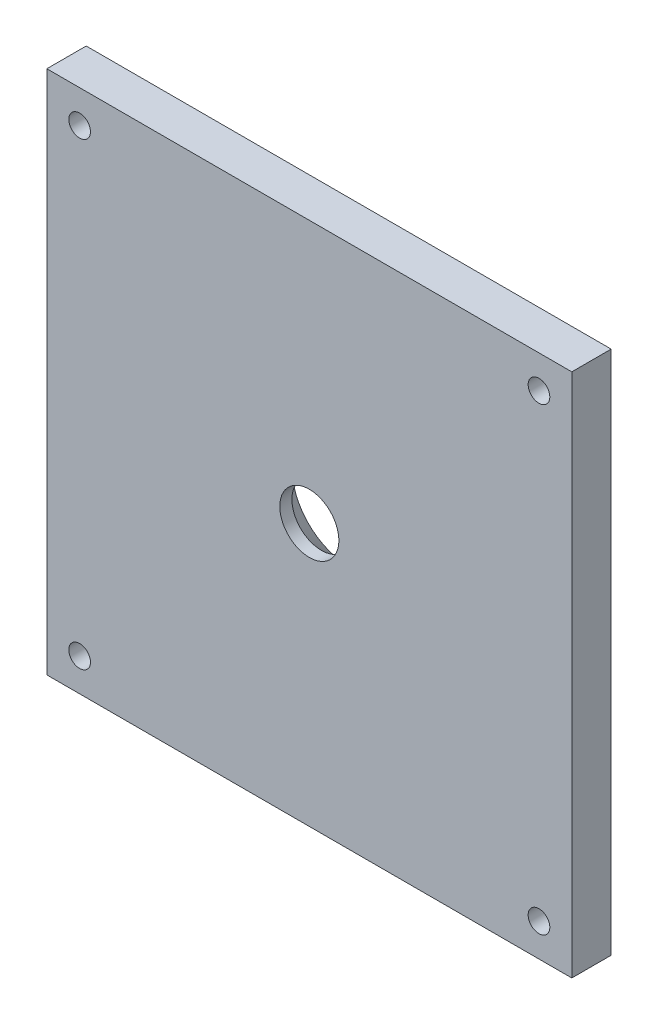
ISO-10303-21;
HEADER;
FILE_DESCRIPTION(('STEP AP214'),'2;1');
FILE_NAME('part.step','',(''),(''),'','','');
FILE_SCHEMA(('AUTOMOTIVE_DESIGN { 1 0 10303 214 1 1 1 1 }'));
ENDSEC;
DATA;
#1=APPLICATION_CONTEXT('core data for automotive mechanical design processes');
#2=APPLICATION_PROTOCOL_DEFINITION('international standard','automotive_design',2000,#1);
#3=PRODUCT_CONTEXT('',#1,'mechanical');
#4=PRODUCT('Part','Part','',(#3));
#5=PRODUCT_RELATED_PRODUCT_CATEGORY('part','',(#4));
#6=PRODUCT_DEFINITION_FORMATION('','',#4);
#7=PRODUCT_DEFINITION_CONTEXT('part definition',#1,'design');
#8=PRODUCT_DEFINITION('design','',#6,#7);
#9=PRODUCT_DEFINITION_SHAPE('','',#8);
#10=(LENGTH_UNIT() NAMED_UNIT(*) SI_UNIT(.MILLI.,.METRE.));
#11=(NAMED_UNIT(*) PLANE_ANGLE_UNIT() SI_UNIT($,.RADIAN.));
#12=(NAMED_UNIT(*) SI_UNIT($,.STERADIAN.) SOLID_ANGLE_UNIT());
#13=UNCERTAINTY_MEASURE_WITH_UNIT(LENGTH_MEASURE(1.E-05),#10,'distance_accuracy_value','');
#14=(GEOMETRIC_REPRESENTATION_CONTEXT(3) GLOBAL_UNCERTAINTY_ASSIGNED_CONTEXT((#13)) GLOBAL_UNIT_ASSIGNED_CONTEXT((#10,
#11,#12)) REPRESENTATION_CONTEXT('',''));
#15=CARTESIAN_POINT('',(0.,0.,0.));
#16=DIRECTION('',(0.,0.,1.));
#17=DIRECTION('',(1.,0.,0.));
#18=AXIS2_PLACEMENT_3D('',#15,#16,#17);
#19=CARTESIAN_POINT('',(0.,0.,6.));
#20=DIRECTION('',(0.,0.,1.));
#21=DIRECTION('',(1.,0.,0.));
#22=AXIS2_PLACEMENT_3D('',#19,#20,#21);
#23=PLANE('',#22);
#24=CARTESIAN_POINT('',(0.,0.,6.));
#25=DIRECTION('',(0.,0.,-1.));
#26=DIRECTION('',(-1.,0.,0.));
#27=AXIS2_PLACEMENT_3D('',#24,#25,#26);
#28=CIRCLE('',#27,4.5);
#29=CARTESIAN_POINT('',(-4.5,0.,6.));
#30=VERTEX_POINT('',#29);
#31=EDGE_CURVE('E141',#30,#30,#28,.T.);
#32=ORIENTED_EDGE('',*,*,#31,.T.);
#33=EDGE_LOOP('',(#32));
#34=FACE_BOUND('',#33,.T.);
#35=CARTESIAN_POINT('',(-35.0000000000001,35.,6.));
#36=DIRECTION('',(0.,0.,1.));
#37=DIRECTION('',(1.,0.,0.));
#38=AXIS2_PLACEMENT_3D('',#35,#36,#37);
#39=CIRCLE('',#38,1.64999999999999);
#40=CARTESIAN_POINT('',(-33.3500000000001,35.,6.));
#41=VERTEX_POINT('',#40);
#42=EDGE_CURVE('E135',#41,#41,#39,.T.);
#43=ORIENTED_EDGE('',*,*,#42,.F.);
#44=EDGE_LOOP('',(#43));
#45=FACE_BOUND('',#44,.T.);
#46=CARTESIAN_POINT('',(-34.9999999999999,-34.9999999999995,6.));
#47=DIRECTION('',(0.,0.,1.));
#48=DIRECTION('',(1.,0.,0.));
#49=AXIS2_PLACEMENT_3D('',#46,#47,#48);
#50=CIRCLE('',#49,1.64999999999999);
#51=CARTESIAN_POINT('',(-33.3499999999999,-34.9999999999995,6.));
#52=VERTEX_POINT('',#51);
#53=EDGE_CURVE('E129',#52,#52,#50,.T.);
#54=ORIENTED_EDGE('',*,*,#53,.F.);
#55=EDGE_LOOP('',(#54));
#56=FACE_BOUND('',#55,.T.);
#57=CARTESIAN_POINT('',(35.0000000000004,-34.9999999999997,6.));
#58=DIRECTION('',(0.,0.,1.));
#59=DIRECTION('',(1.,0.,0.));
#60=AXIS2_PLACEMENT_3D('',#57,#58,#59);
#61=CIRCLE('',#60,1.64999999999999);
#62=CARTESIAN_POINT('',(36.6500000000003,-34.9999999999997,6.));
#63=VERTEX_POINT('',#62);
#64=EDGE_CURVE('E123',#63,#63,#61,.T.);
#65=ORIENTED_EDGE('',*,*,#64,.F.);
#66=EDGE_LOOP('',(#65));
#67=FACE_BOUND('',#66,.T.);
#68=CARTESIAN_POINT('',(34.9999999999997,35.,6.));
#69=DIRECTION('',(0.,0.,1.));
#70=DIRECTION('',(1.,0.,0.));
#71=AXIS2_PLACEMENT_3D('',#68,#69,#70);
#72=CIRCLE('',#71,1.64999999999999);
#73=CARTESIAN_POINT('',(36.6499999999996,35.,6.));
#74=VERTEX_POINT('',#73);
#75=EDGE_CURVE('E107',#74,#74,#72,.T.);
#76=ORIENTED_EDGE('',*,*,#75,.F.);
#77=EDGE_LOOP('',(#76));
#78=FACE_BOUND('',#77,.T.);
#79=DIRECTION('',(0.,-1.,0.));
#80=VECTOR('',#79,1.);
#81=CARTESIAN_POINT('',(-40.,40.,6.));
#82=LINE('',#81,#80);
#83=CARTESIAN_POINT('',(-40.,40.,6.));
#84=VERTEX_POINT('',#83);
#85=CARTESIAN_POINT('',(-40.,-40.,6.));
#86=VERTEX_POINT('',#85);
#87=EDGE_CURVE('E92',#84,#86,#82,.T.);
#88=ORIENTED_EDGE('',*,*,#87,.T.);
#89=DIRECTION('',(1.,0.,0.));
#90=VECTOR('',#89,1.);
#91=CARTESIAN_POINT('',(-40.,-40.,6.));
#92=LINE('',#91,#90);
#93=CARTESIAN_POINT('',(40.,-40.,6.));
#94=VERTEX_POINT('',#93);
#95=EDGE_CURVE('E88',#86,#94,#92,.T.);
#96=ORIENTED_EDGE('',*,*,#95,.T.);
#97=DIRECTION('',(0.,1.,0.));
#98=VECTOR('',#97,1.);
#99=CARTESIAN_POINT('',(40.,40.,6.));
#100=LINE('',#99,#98);
#101=CARTESIAN_POINT('',(40.,40.,6.));
#102=VERTEX_POINT('',#101);
#103=EDGE_CURVE('E90',#94,#102,#100,.T.);
#104=ORIENTED_EDGE('',*,*,#103,.T.);
#105=DIRECTION('',(-1.,0.,0.));
#106=VECTOR('',#105,1.);
#107=CARTESIAN_POINT('',(-40.,40.,6.));
#108=LINE('',#107,#106);
#109=EDGE_CURVE('E58',#102,#84,#108,.T.);
#110=ORIENTED_EDGE('',*,*,#109,.T.);
#111=EDGE_LOOP('',(#88,#96,#104,#110));
#112=FACE_BOUND('',#111,.T.);
#113=ADVANCED_FACE('F41',(#34,#45,#56,#67,#78,#112),#23,.T.);
#114=CARTESIAN_POINT('',(0.,0.,0.));
#115=DIRECTION('',(0.,0.,1.));
#116=DIRECTION('',(1.,0.,0.));
#117=AXIS2_PLACEMENT_3D('',#114,#115,#116);
#118=PLANE('',#117);
#119=CARTESIAN_POINT('',(0.,0.,0.));
#120=DIRECTION('',(0.,0.,-1.));
#121=DIRECTION('',(-1.,0.,0.));
#122=AXIS2_PLACEMENT_3D('',#119,#120,#121);
#123=CIRCLE('',#122,8.65);
#124=CARTESIAN_POINT('',(-8.65,0.,0.));
#125=VERTEX_POINT('',#124);
#126=EDGE_CURVE('E149',#125,#125,#123,.T.);
#127=ORIENTED_EDGE('',*,*,#126,.F.);
#128=EDGE_LOOP('',(#127));
#129=FACE_BOUND('',#128,.T.);
#130=CARTESIAN_POINT('',(-35.0000000000001,35.,0.));
#131=DIRECTION('',(0.,0.,-1.));
#132=DIRECTION('',(-1.,0.,0.));
#133=AXIS2_PLACEMENT_3D('',#130,#131,#132);
#134=CIRCLE('',#133,1.64999999999999);
#135=CARTESIAN_POINT('',(-36.6500000000001,35.,0.));
#136=VERTEX_POINT('',#135);
#137=EDGE_CURVE('E138',#136,#136,#134,.T.);
#138=ORIENTED_EDGE('',*,*,#137,.F.);
#139=EDGE_LOOP('',(#138));
#140=FACE_BOUND('',#139,.T.);
#141=CARTESIAN_POINT('',(-34.9999999999999,-34.9999999999995,0.));
#142=DIRECTION('',(0.,0.,-1.));
#143=DIRECTION('',(-1.,0.,0.));
#144=AXIS2_PLACEMENT_3D('',#141,#142,#143);
#145=CIRCLE('',#144,1.64999999999999);
#146=CARTESIAN_POINT('',(-36.6499999999999,-34.9999999999995,0.));
#147=VERTEX_POINT('',#146);
#148=EDGE_CURVE('E132',#147,#147,#145,.T.);
#149=ORIENTED_EDGE('',*,*,#148,.F.);
#150=EDGE_LOOP('',(#149));
#151=FACE_BOUND('',#150,.T.);
#152=CARTESIAN_POINT('',(35.0000000000004,-34.9999999999997,0.));
#153=DIRECTION('',(0.,0.,-1.));
#154=DIRECTION('',(-1.,0.,0.));
#155=AXIS2_PLACEMENT_3D('',#152,#153,#154);
#156=CIRCLE('',#155,1.64999999999999);
#157=CARTESIAN_POINT('',(33.3500000000004,-34.9999999999997,0.));
#158=VERTEX_POINT('',#157);
#159=EDGE_CURVE('E126',#158,#158,#156,.T.);
#160=ORIENTED_EDGE('',*,*,#159,.F.);
#161=EDGE_LOOP('',(#160));
#162=FACE_BOUND('',#161,.T.);
#163=CARTESIAN_POINT('',(34.9999999999997,35.,0.));
#164=DIRECTION('',(0.,0.,-1.));
#165=DIRECTION('',(-1.,0.,0.));
#166=AXIS2_PLACEMENT_3D('',#163,#164,#165);
#167=CIRCLE('',#166,1.64999999999999);
#168=CARTESIAN_POINT('',(33.3499999999997,35.,0.));
#169=VERTEX_POINT('',#168);
#170=EDGE_CURVE('E120',#169,#169,#167,.T.);
#171=ORIENTED_EDGE('',*,*,#170,.F.);
#172=EDGE_LOOP('',(#171));
#173=FACE_BOUND('',#172,.T.);
#174=DIRECTION('',(0.,-1.,0.));
#175=VECTOR('',#174,1.);
#176=CARTESIAN_POINT('',(-40.,40.,0.));
#177=LINE('',#176,#175);
#178=CARTESIAN_POINT('',(-40.,40.,0.));
#179=VERTEX_POINT('',#178);
#180=CARTESIAN_POINT('',(-40.,-40.,0.));
#181=VERTEX_POINT('',#180);
#182=EDGE_CURVE('E104',#179,#181,#177,.T.);
#183=ORIENTED_EDGE('',*,*,#182,.F.);
#184=DIRECTION('',(-1.,0.,0.));
#185=VECTOR('',#184,1.);
#186=CARTESIAN_POINT('',(-40.,40.,0.));
#187=LINE('',#186,#185);
#188=CARTESIAN_POINT('',(40.,40.,0.));
#189=VERTEX_POINT('',#188);
#190=EDGE_CURVE('E81',#189,#179,#187,.T.);
#191=ORIENTED_EDGE('',*,*,#190,.F.);
#192=DIRECTION('',(0.,1.,0.));
#193=VECTOR('',#192,1.);
#194=CARTESIAN_POINT('',(40.,40.,0.));
#195=LINE('',#194,#193);
#196=CARTESIAN_POINT('',(40.,-40.,0.));
#197=VERTEX_POINT('',#196);
#198=EDGE_CURVE('E75',#197,#189,#195,.T.);
#199=ORIENTED_EDGE('',*,*,#198,.F.);
#200=DIRECTION('',(1.,0.,0.));
#201=VECTOR('',#200,1.);
#202=CARTESIAN_POINT('',(-40.,-40.,0.));
#203=LINE('',#202,#201);
#204=EDGE_CURVE('E96',#181,#197,#203,.T.);
#205=ORIENTED_EDGE('',*,*,#204,.F.);
#206=EDGE_LOOP('',(#183,#191,#199,#205));
#207=FACE_BOUND('',#206,.T.);
#208=ADVANCED_FACE('F115',(#129,#140,#151,#162,#173,#207),#118,.F.);
#209=CARTESIAN_POINT('',(-40.,40.,6.));
#210=DIRECTION('',(1.,0.,0.));
#211=DIRECTION('',(0.,1.,0.));
#212=AXIS2_PLACEMENT_3D('',#209,#210,#211);
#213=PLANE('',#212);
#214=ORIENTED_EDGE('',*,*,#182,.T.);
#215=DIRECTION('',(0.,0.,-1.));
#216=VECTOR('',#215,1.);
#217=CARTESIAN_POINT('',(-40.,-40.,6.));
#218=LINE('',#217,#216);
#219=EDGE_CURVE('E11',#86,#181,#218,.T.);
#220=ORIENTED_EDGE('',*,*,#219,.F.);
#221=ORIENTED_EDGE('',*,*,#87,.F.);
#222=DIRECTION('',(0.,0.,-1.));
#223=VECTOR('',#222,1.);
#224=CARTESIAN_POINT('',(-40.,40.,6.));
#225=LINE('',#224,#223);
#226=EDGE_CURVE('E100',#84,#179,#225,.T.);
#227=ORIENTED_EDGE('',*,*,#226,.T.);
#228=EDGE_LOOP('',(#214,#220,#221,#227));
#229=FACE_BOUND('',#228,.T.);
#230=ADVANCED_FACE('F43',(#229),#213,.F.);
#231=CARTESIAN_POINT('',(-40.,-40.,6.));
#232=DIRECTION('',(0.,1.,0.));
#233=DIRECTION('',(-1.,0.,0.));
#234=AXIS2_PLACEMENT_3D('',#231,#232,#233);
#235=PLANE('',#234);
#236=ORIENTED_EDGE('',*,*,#204,.T.);
#237=DIRECTION('',(0.,0.,-1.));
#238=VECTOR('',#237,1.);
#239=CARTESIAN_POINT('',(40.,-40.,6.));
#240=LINE('',#239,#238);
#241=EDGE_CURVE('E50',#94,#197,#240,.T.);
#242=ORIENTED_EDGE('',*,*,#241,.F.);
#243=ORIENTED_EDGE('',*,*,#95,.F.);
#244=ORIENTED_EDGE('',*,*,#219,.T.);
#245=EDGE_LOOP('',(#236,#242,#243,#244));
#246=FACE_BOUND('',#245,.T.);
#247=ADVANCED_FACE('F95',(#246),#235,.F.);
#248=CARTESIAN_POINT('',(40.,40.,6.));
#249=DIRECTION('',(-1.,0.,0.));
#250=DIRECTION('',(0.,0.,1.));
#251=AXIS2_PLACEMENT_3D('',#248,#249,#250);
#252=PLANE('',#251);
#253=ORIENTED_EDGE('',*,*,#198,.T.);
#254=DIRECTION('',(0.,0.,-1.));
#255=VECTOR('',#254,1.);
#256=CARTESIAN_POINT('',(40.,40.,6.));
#257=LINE('',#256,#255);
#258=EDGE_CURVE('E97',#102,#189,#257,.T.);
#259=ORIENTED_EDGE('',*,*,#258,.F.);
#260=ORIENTED_EDGE('',*,*,#103,.F.);
#261=ORIENTED_EDGE('',*,*,#241,.T.);
#262=EDGE_LOOP('',(#253,#259,#260,#261));
#263=FACE_BOUND('',#262,.T.);
#264=ADVANCED_FACE('F98',(#263),#252,.F.);
#265=CARTESIAN_POINT('',(-40.,40.,6.));
#266=DIRECTION('',(0.,-1.,0.));
#267=DIRECTION('',(1.,0.,0.));
#268=AXIS2_PLACEMENT_3D('',#265,#266,#267);
#269=PLANE('',#268);
#270=ORIENTED_EDGE('',*,*,#190,.T.);
#271=ORIENTED_EDGE('',*,*,#226,.F.);
#272=ORIENTED_EDGE('',*,*,#109,.F.);
#273=ORIENTED_EDGE('',*,*,#258,.T.);
#274=EDGE_LOOP('',(#270,#271,#272,#273));
#275=FACE_BOUND('',#274,.T.);
#276=ADVANCED_FACE('F112',(#275),#269,.F.);
#277=CARTESIAN_POINT('',(34.9999999999997,35.,0.));
#278=DIRECTION('',(0.,0.,-1.));
#279=DIRECTION('',(-1.,0.,0.));
#280=AXIS2_PLACEMENT_3D('',#277,#278,#279);
#281=CYLINDRICAL_SURFACE('',#280,1.64999999999999);
#282=ORIENTED_EDGE('',*,*,#75,.T.);
#283=EDGE_LOOP('',(#282));
#284=FACE_BOUND('',#283,.T.);
#285=ORIENTED_EDGE('',*,*,#170,.T.);
#286=EDGE_LOOP('',(#285));
#287=FACE_BOUND('',#286,.T.);
#288=ADVANCED_FACE('F167',(#284,#287),#281,.F.);
#289=CARTESIAN_POINT('',(35.0000000000004,-34.9999999999997,0.));
#290=DIRECTION('',(0.,0.,-1.));
#291=DIRECTION('',(-1.,0.,0.));
#292=AXIS2_PLACEMENT_3D('',#289,#290,#291);
#293=CYLINDRICAL_SURFACE('',#292,1.64999999999999);
#294=ORIENTED_EDGE('',*,*,#64,.T.);
#295=EDGE_LOOP('',(#294));
#296=FACE_BOUND('',#295,.T.);
#297=ORIENTED_EDGE('',*,*,#159,.T.);
#298=EDGE_LOOP('',(#297));
#299=FACE_BOUND('',#298,.T.);
#300=ADVANCED_FACE('F169',(#296,#299),#293,.F.);
#301=CARTESIAN_POINT('',(-34.9999999999999,-34.9999999999995,0.));
#302=DIRECTION('',(0.,0.,-1.));
#303=DIRECTION('',(-1.,0.,0.));
#304=AXIS2_PLACEMENT_3D('',#301,#302,#303);
#305=CYLINDRICAL_SURFACE('',#304,1.64999999999999);
#306=ORIENTED_EDGE('',*,*,#53,.T.);
#307=EDGE_LOOP('',(#306));
#308=FACE_BOUND('',#307,.T.);
#309=ORIENTED_EDGE('',*,*,#148,.T.);
#310=EDGE_LOOP('',(#309));
#311=FACE_BOUND('',#310,.T.);
#312=ADVANCED_FACE('F176',(#308,#311),#305,.F.);
#313=CARTESIAN_POINT('',(-35.0000000000001,35.,0.));
#314=DIRECTION('',(0.,0.,-1.));
#315=DIRECTION('',(-1.,0.,0.));
#316=AXIS2_PLACEMENT_3D('',#313,#314,#315);
#317=CYLINDRICAL_SURFACE('',#316,1.64999999999999);
#318=ORIENTED_EDGE('',*,*,#42,.T.);
#319=EDGE_LOOP('',(#318));
#320=FACE_BOUND('',#319,.T.);
#321=ORIENTED_EDGE('',*,*,#137,.T.);
#322=EDGE_LOOP('',(#321));
#323=FACE_BOUND('',#322,.T.);
#324=ADVANCED_FACE('F211',(#320,#323),#317,.F.);
#325=CARTESIAN_POINT('',(0.,0.,0.));
#326=DIRECTION('',(0.,0.,-1.));
#327=DIRECTION('',(-1.,0.,0.));
#328=AXIS2_PLACEMENT_3D('',#325,#326,#327);
#329=CYLINDRICAL_SURFACE('',#328,4.5);
#330=ORIENTED_EDGE('',*,*,#31,.F.);
#331=EDGE_LOOP('',(#330));
#332=FACE_BOUND('',#331,.T.);
#333=CARTESIAN_POINT('',(0.,0.,4.15));
#334=DIRECTION('',(0.,0.,-1.));
#335=DIRECTION('',(-1.,0.,0.));
#336=AXIS2_PLACEMENT_3D('',#333,#334,#335);
#337=CIRCLE('',#336,4.5);
#338=CARTESIAN_POINT('',(-4.5,0.,4.15));
#339=VERTEX_POINT('',#338);
#340=EDGE_CURVE('E145',#339,#339,#337,.T.);
#341=ORIENTED_EDGE('',*,*,#340,.T.);
#342=EDGE_LOOP('',(#341));
#343=FACE_BOUND('',#342,.T.);
#344=ADVANCED_FACE('F206',(#332,#343),#329,.F.);
#345=CARTESIAN_POINT('',(0.,0.,0.));
#346=DIRECTION('',(0.,0.,-1.));
#347=DIRECTION('',(-1.,0.,0.));
#348=AXIS2_PLACEMENT_3D('',#345,#346,#347);
#349=CONICAL_SURFACE('',#348,8.65,0.785398163397449);
#350=ORIENTED_EDGE('',*,*,#340,.F.);
#351=EDGE_LOOP('',(#350));
#352=FACE_BOUND('',#351,.T.);
#353=ORIENTED_EDGE('',*,*,#126,.T.);
#354=EDGE_LOOP('',(#353));
#355=FACE_BOUND('',#354,.T.);
#356=ADVANCED_FACE('F154',(#352,#355),#349,.F.);
#357=CLOSED_SHELL('',(#113,#208,#230,#247,#264,#276,#288,#300,#312,#324,#344,#356));
#358=MANIFOLD_SOLID_BREP('B2',#357);
#359=ADVANCED_BREP_SHAPE_REPRESENTATION('',(#18,#358),#14);
#360=SHAPE_DEFINITION_REPRESENTATION(#9,#359);
ENDSEC;
END-ISO-10303-21;
